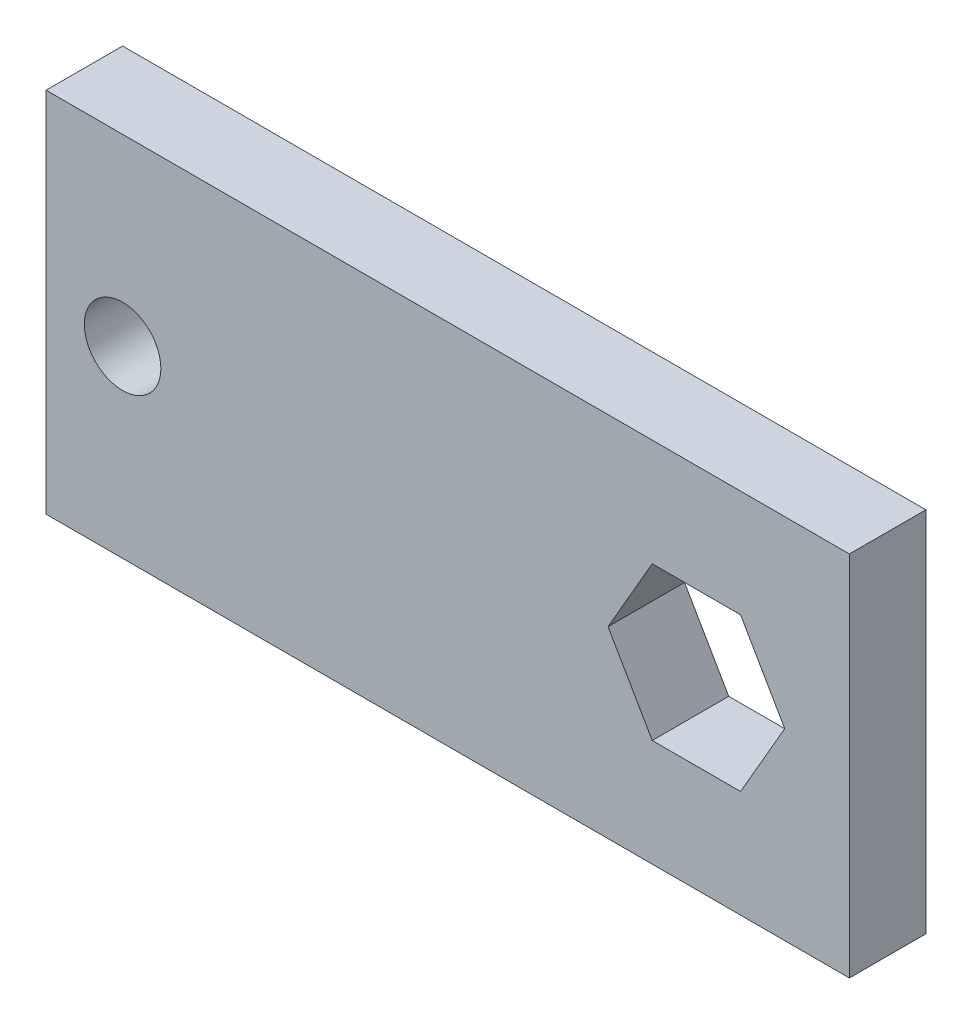
ISO-10303-21;
HEADER;
FILE_DESCRIPTION(('STEP AP214'),'2;1');
FILE_NAME('part.step','',(''),(''),'','','');
FILE_SCHEMA(('AUTOMOTIVE_DESIGN { 1 0 10303 214 1 1 1 1 }'));
ENDSEC;
DATA;
#1=APPLICATION_CONTEXT('core data for automotive mechanical design processes');
#2=APPLICATION_PROTOCOL_DEFINITION('international standard','automotive_design',2000,#1);
#3=PRODUCT_CONTEXT('',#1,'mechanical');
#4=PRODUCT('Part','Part','',(#3));
#5=PRODUCT_RELATED_PRODUCT_CATEGORY('part','',(#4));
#6=PRODUCT_DEFINITION_FORMATION('','',#4);
#7=PRODUCT_DEFINITION_CONTEXT('part definition',#1,'design');
#8=PRODUCT_DEFINITION('design','',#6,#7);
#9=PRODUCT_DEFINITION_SHAPE('','',#8);
#10=(LENGTH_UNIT() NAMED_UNIT(*) SI_UNIT(.MILLI.,.METRE.));
#11=(NAMED_UNIT(*) PLANE_ANGLE_UNIT() SI_UNIT($,.RADIAN.));
#12=(NAMED_UNIT(*) SI_UNIT($,.STERADIAN.) SOLID_ANGLE_UNIT());
#13=UNCERTAINTY_MEASURE_WITH_UNIT(LENGTH_MEASURE(1.E-05),#10,'distance_accuracy_value','');
#14=(GEOMETRIC_REPRESENTATION_CONTEXT(3) GLOBAL_UNCERTAINTY_ASSIGNED_CONTEXT((#13)) GLOBAL_UNIT_ASSIGNED_CONTEXT((#10,
#11,#12)) REPRESENTATION_CONTEXT('',''));
#15=CARTESIAN_POINT('',(0.,0.,0.));
#16=DIRECTION('',(0.,0.,1.));
#17=DIRECTION('',(1.,0.,0.));
#18=AXIS2_PLACEMENT_3D('',#15,#16,#17);
#19=CARTESIAN_POINT('',(0.,15.24,6.35));
#20=DIRECTION('',(0.,-1.,0.));
#21=DIRECTION('',(1.,0.,0.));
#22=AXIS2_PLACEMENT_3D('',#19,#20,#21);
#23=PLANE('',#22);
#24=DIRECTION('',(-1.,0.,0.));
#25=VECTOR('',#24,1.);
#26=CARTESIAN_POINT('',(0.,15.24,0.));
#27=LINE('',#26,#25);
#28=CARTESIAN_POINT('',(12.7,15.24,0.));
#29=VERTEX_POINT('',#28);
#30=CARTESIAN_POINT('',(-53.975,15.24,0.));
#31=VERTEX_POINT('',#30);
#32=EDGE_CURVE('E163',#29,#31,#27,.T.);
#33=ORIENTED_EDGE('',*,*,#32,.T.);
#34=DIRECTION('',(0.,0.,-1.));
#35=VECTOR('',#34,1.);
#36=CARTESIAN_POINT('',(-53.975,15.24,6.35));
#37=LINE('',#36,#35);
#38=CARTESIAN_POINT('',(-53.975,15.24,6.35));
#39=VERTEX_POINT('',#38);
#40=EDGE_CURVE('E11',#39,#31,#37,.T.);
#41=ORIENTED_EDGE('',*,*,#40,.F.);
#42=DIRECTION('',(-1.,0.,0.));
#43=VECTOR('',#42,1.);
#44=CARTESIAN_POINT('',(0.,15.24,6.35));
#45=LINE('',#44,#43);
#46=CARTESIAN_POINT('',(12.7,15.24,6.35));
#47=VERTEX_POINT('',#46);
#48=EDGE_CURVE('E125',#47,#39,#45,.T.);
#49=ORIENTED_EDGE('',*,*,#48,.F.);
#50=DIRECTION('',(0.,0.,-1.));
#51=VECTOR('',#50,1.);
#52=CARTESIAN_POINT('',(12.7,15.24,6.35));
#53=LINE('',#52,#51);
#54=EDGE_CURVE('E53',#47,#29,#53,.T.);
#55=ORIENTED_EDGE('',*,*,#54,.T.);
#56=EDGE_LOOP('',(#33,#41,#49,#55));
#57=FACE_BOUND('',#56,.T.);
#58=ADVANCED_FACE('F34',(#57),#23,.F.);
#59=CARTESIAN_POINT('',(-53.975,0.,6.35));
#60=DIRECTION('',(1.,0.,0.));
#61=DIRECTION('',(0.,0.,-1.));
#62=AXIS2_PLACEMENT_3D('',#59,#60,#61);
#63=PLANE('',#62);
#64=DIRECTION('',(0.,-1.,0.));
#65=VECTOR('',#64,1.);
#66=CARTESIAN_POINT('',(-53.975,0.,0.));
#67=LINE('',#66,#65);
#68=CARTESIAN_POINT('',(-53.975,-15.24,0.));
#69=VERTEX_POINT('',#68);
#70=EDGE_CURVE('E131',#31,#69,#67,.T.);
#71=ORIENTED_EDGE('',*,*,#70,.T.);
#72=DIRECTION('',(0.,0.,-1.));
#73=VECTOR('',#72,1.);
#74=CARTESIAN_POINT('',(-53.975,-15.24,6.35));
#75=LINE('',#74,#73);
#76=CARTESIAN_POINT('',(-53.975,-15.24,6.35));
#77=VERTEX_POINT('',#76);
#78=EDGE_CURVE('E44',#77,#69,#75,.T.);
#79=ORIENTED_EDGE('',*,*,#78,.F.);
#80=DIRECTION('',(0.,-1.,0.));
#81=VECTOR('',#80,1.);
#82=CARTESIAN_POINT('',(-53.975,0.,6.35));
#83=LINE('',#82,#81);
#84=EDGE_CURVE('E119',#39,#77,#83,.T.);
#85=ORIENTED_EDGE('',*,*,#84,.F.);
#86=ORIENTED_EDGE('',*,*,#40,.T.);
#87=EDGE_LOOP('',(#71,#79,#85,#86));
#88=FACE_BOUND('',#87,.T.);
#89=ADVANCED_FACE('F130',(#88),#63,.F.);
#90=CARTESIAN_POINT('',(0.,-15.24,6.35));
#91=DIRECTION('',(0.,-1.,0.));
#92=DIRECTION('',(1.,0.,0.));
#93=AXIS2_PLACEMENT_3D('',#90,#91,#92);
#94=PLANE('',#93);
#95=DIRECTION('',(-1.,0.,0.));
#96=VECTOR('',#95,1.);
#97=CARTESIAN_POINT('',(0.,-15.24,0.));
#98=LINE('',#97,#96);
#99=CARTESIAN_POINT('',(12.7,-15.24,0.));
#100=VERTEX_POINT('',#99);
#101=EDGE_CURVE('E166',#100,#69,#98,.T.);
#102=ORIENTED_EDGE('',*,*,#101,.F.);
#103=DIRECTION('',(0.,0.,-1.));
#104=VECTOR('',#103,1.);
#105=CARTESIAN_POINT('',(12.7,-15.24,6.35));
#106=LINE('',#105,#104);
#107=CARTESIAN_POINT('',(12.7,-15.24,6.35));
#108=VERTEX_POINT('',#107);
#109=EDGE_CURVE('E85',#108,#100,#106,.T.);
#110=ORIENTED_EDGE('',*,*,#109,.F.);
#111=DIRECTION('',(-1.,0.,0.));
#112=VECTOR('',#111,1.);
#113=CARTESIAN_POINT('',(0.,-15.24,6.35));
#114=LINE('',#113,#112);
#115=EDGE_CURVE('E124',#108,#77,#114,.T.);
#116=ORIENTED_EDGE('',*,*,#115,.T.);
#117=ORIENTED_EDGE('',*,*,#78,.T.);
#118=EDGE_LOOP('',(#102,#110,#116,#117));
#119=FACE_BOUND('',#118,.T.);
#120=ADVANCED_FACE('F135',(#119),#94,.T.);
#121=CARTESIAN_POINT('',(5.49926131403119,3.175,6.35));
#122=DIRECTION('',(-0.866025403784438,-0.5,0.));
#123=DIRECTION('',(0.5,-0.866025403784438,0.));
#124=AXIS2_PLACEMENT_3D('',#121,#122,#123);
#125=PLANE('',#124);
#126=DIRECTION('',(-0.5,0.866025403784438,0.));
#127=VECTOR('',#126,1.);
#128=CARTESIAN_POINT('',(5.49926131403119,3.175,0.));
#129=LINE('',#128,#127);
#130=CARTESIAN_POINT('',(7.33234841870825,0.,0.));
#131=VERTEX_POINT('',#130);
#132=CARTESIAN_POINT('',(3.66617420935412,6.35,0.));
#133=VERTEX_POINT('',#132);
#134=EDGE_CURVE('E145',#131,#133,#129,.T.);
#135=ORIENTED_EDGE('',*,*,#134,.F.);
#136=DIRECTION('',(0.,0.,-1.));
#137=VECTOR('',#136,1.);
#138=CARTESIAN_POINT('',(7.33234841870825,0.,6.35));
#139=LINE('',#138,#137);
#140=CARTESIAN_POINT('',(7.33234841870825,0.,6.35));
#141=VERTEX_POINT('',#140);
#142=EDGE_CURVE('E38',#141,#131,#139,.T.);
#143=ORIENTED_EDGE('',*,*,#142,.F.);
#144=DIRECTION('',(-0.5,0.866025403784438,0.));
#145=VECTOR('',#144,1.);
#146=CARTESIAN_POINT('',(5.49926131403119,3.175,6.35));
#147=LINE('',#146,#145);
#148=CARTESIAN_POINT('',(3.66617420935412,6.35,6.35));
#149=VERTEX_POINT('',#148);
#150=EDGE_CURVE('E219',#141,#149,#147,.T.);
#151=ORIENTED_EDGE('',*,*,#150,.T.);
#152=DIRECTION('',(0.,0.,-1.));
#153=VECTOR('',#152,1.);
#154=CARTESIAN_POINT('',(3.66617420935412,6.35,6.35));
#155=LINE('',#154,#153);
#156=EDGE_CURVE('E138',#149,#133,#155,.T.);
#157=ORIENTED_EDGE('',*,*,#156,.T.);
#158=EDGE_LOOP('',(#135,#143,#151,#157));
#159=FACE_BOUND('',#158,.T.);
#160=ADVANCED_FACE('F190',(#159),#125,.T.);
#161=CARTESIAN_POINT('',(5.49926131403119,-3.175,6.35));
#162=DIRECTION('',(-0.866025403784439,0.5,0.));
#163=DIRECTION('',(-0.5,-0.866025403784439,0.));
#164=AXIS2_PLACEMENT_3D('',#161,#162,#163);
#165=PLANE('',#164);
#166=DIRECTION('',(0.5,0.866025403784439,0.));
#167=VECTOR('',#166,1.);
#168=CARTESIAN_POINT('',(5.49926131403119,-3.175,0.));
#169=LINE('',#168,#167);
#170=CARTESIAN_POINT('',(3.66617420935413,-6.35,0.));
#171=VERTEX_POINT('',#170);
#172=EDGE_CURVE('E148',#171,#131,#169,.T.);
#173=ORIENTED_EDGE('',*,*,#172,.F.);
#174=DIRECTION('',(0.,0.,-1.));
#175=VECTOR('',#174,1.);
#176=CARTESIAN_POINT('',(3.66617420935413,-6.35,6.35));
#177=LINE('',#176,#175);
#178=CARTESIAN_POINT('',(3.66617420935413,-6.35,6.35));
#179=VERTEX_POINT('',#178);
#180=EDGE_CURVE('E180',#179,#171,#177,.T.);
#181=ORIENTED_EDGE('',*,*,#180,.F.);
#182=DIRECTION('',(0.5,0.866025403784439,0.));
#183=VECTOR('',#182,1.);
#184=CARTESIAN_POINT('',(5.49926131403119,-3.175,6.35));
#185=LINE('',#184,#183);
#186=EDGE_CURVE('E189',#179,#141,#185,.T.);
#187=ORIENTED_EDGE('',*,*,#186,.T.);
#188=ORIENTED_EDGE('',*,*,#142,.T.);
#189=EDGE_LOOP('',(#173,#181,#187,#188));
#190=FACE_BOUND('',#189,.T.);
#191=ADVANCED_FACE('F187',(#190),#165,.T.);
#192=CARTESIAN_POINT('',(0.,-6.35,6.35));
#193=DIRECTION('',(0.,1.,0.));
#194=DIRECTION('',(-1.,0.,0.));
#195=AXIS2_PLACEMENT_3D('',#192,#193,#194);
#196=PLANE('',#195);
#197=DIRECTION('',(1.,0.,0.));
#198=VECTOR('',#197,1.);
#199=CARTESIAN_POINT('',(0.,-6.35,0.));
#200=LINE('',#199,#198);
#201=CARTESIAN_POINT('',(-3.66617420935412,-6.35,0.));
#202=VERTEX_POINT('',#201);
#203=EDGE_CURVE('E151',#202,#171,#200,.T.);
#204=ORIENTED_EDGE('',*,*,#203,.F.);
#205=DIRECTION('',(0.,0.,-1.));
#206=VECTOR('',#205,1.);
#207=CARTESIAN_POINT('',(-3.66617420935412,-6.35,6.35));
#208=LINE('',#207,#206);
#209=CARTESIAN_POINT('',(-3.66617420935412,-6.35,6.35));
#210=VERTEX_POINT('',#209);
#211=EDGE_CURVE('E179',#210,#202,#208,.T.);
#212=ORIENTED_EDGE('',*,*,#211,.F.);
#213=DIRECTION('',(1.,0.,0.));
#214=VECTOR('',#213,1.);
#215=CARTESIAN_POINT('',(0.,-6.35,6.35));
#216=LINE('',#215,#214);
#217=EDGE_CURVE('E198',#210,#179,#216,.T.);
#218=ORIENTED_EDGE('',*,*,#217,.T.);
#219=ORIENTED_EDGE('',*,*,#180,.T.);
#220=EDGE_LOOP('',(#204,#212,#218,#219));
#221=FACE_BOUND('',#220,.T.);
#222=ADVANCED_FACE('F196',(#221),#196,.T.);
#223=CARTESIAN_POINT('',(-5.49926131403118,-3.175,6.35));
#224=DIRECTION('',(0.866025403784438,0.5,0.));
#225=DIRECTION('',(-0.5,0.866025403784438,0.));
#226=AXIS2_PLACEMENT_3D('',#223,#224,#225);
#227=PLANE('',#226);
#228=DIRECTION('',(0.5,-0.866025403784438,0.));
#229=VECTOR('',#228,1.);
#230=CARTESIAN_POINT('',(-5.49926131403118,-3.175,0.));
#231=LINE('',#230,#229);
#232=CARTESIAN_POINT('',(-7.33234841870825,0.,0.));
#233=VERTEX_POINT('',#232);
#234=EDGE_CURVE('E154',#233,#202,#231,.T.);
#235=ORIENTED_EDGE('',*,*,#234,.F.);
#236=DIRECTION('',(0.,0.,-1.));
#237=VECTOR('',#236,1.);
#238=CARTESIAN_POINT('',(-7.33234841870825,0.,6.35));
#239=LINE('',#238,#237);
#240=CARTESIAN_POINT('',(-7.33234841870825,0.,6.35));
#241=VERTEX_POINT('',#240);
#242=EDGE_CURVE('E177',#241,#233,#239,.T.);
#243=ORIENTED_EDGE('',*,*,#242,.F.);
#244=DIRECTION('',(0.5,-0.866025403784438,0.));
#245=VECTOR('',#244,1.);
#246=CARTESIAN_POINT('',(-5.49926131403118,-3.175,6.35));
#247=LINE('',#246,#245);
#248=EDGE_CURVE('E204',#241,#210,#247,.T.);
#249=ORIENTED_EDGE('',*,*,#248,.T.);
#250=ORIENTED_EDGE('',*,*,#211,.T.);
#251=EDGE_LOOP('',(#235,#243,#249,#250));
#252=FACE_BOUND('',#251,.T.);
#253=ADVANCED_FACE('F207',(#252),#227,.T.);
#254=CARTESIAN_POINT('',(-5.49926131403119,3.175,6.35));
#255=DIRECTION('',(0.866025403784439,-0.5,0.));
#256=DIRECTION('',(0.5,0.866025403784439,0.));
#257=AXIS2_PLACEMENT_3D('',#254,#255,#256);
#258=PLANE('',#257);
#259=DIRECTION('',(-0.5,-0.866025403784439,0.));
#260=VECTOR('',#259,1.);
#261=CARTESIAN_POINT('',(-5.49926131403119,3.175,0.));
#262=LINE('',#261,#260);
#263=CARTESIAN_POINT('',(-3.66617420935413,6.35,0.));
#264=VERTEX_POINT('',#263);
#265=EDGE_CURVE('E157',#264,#233,#262,.T.);
#266=ORIENTED_EDGE('',*,*,#265,.F.);
#267=DIRECTION('',(0.,0.,-1.));
#268=VECTOR('',#267,1.);
#269=CARTESIAN_POINT('',(-3.66617420935413,6.35,6.35));
#270=LINE('',#269,#268);
#271=CARTESIAN_POINT('',(-3.66617420935413,6.35,6.35));
#272=VERTEX_POINT('',#271);
#273=EDGE_CURVE('E175',#272,#264,#270,.T.);
#274=ORIENTED_EDGE('',*,*,#273,.F.);
#275=DIRECTION('',(-0.5,-0.866025403784439,0.));
#276=VECTOR('',#275,1.);
#277=CARTESIAN_POINT('',(-5.49926131403119,3.175,6.35));
#278=LINE('',#277,#276);
#279=EDGE_CURVE('E208',#272,#241,#278,.T.);
#280=ORIENTED_EDGE('',*,*,#279,.T.);
#281=ORIENTED_EDGE('',*,*,#242,.T.);
#282=EDGE_LOOP('',(#266,#274,#280,#281));
#283=FACE_BOUND('',#282,.T.);
#284=ADVANCED_FACE('F221',(#283),#258,.T.);
#285=CARTESIAN_POINT('',(0.,6.35,6.35));
#286=DIRECTION('',(0.,-1.,0.));
#287=DIRECTION('',(1.,0.,0.));
#288=AXIS2_PLACEMENT_3D('',#285,#286,#287);
#289=PLANE('',#288);
#290=DIRECTION('',(-1.,0.,0.));
#291=VECTOR('',#290,1.);
#292=CARTESIAN_POINT('',(0.,6.35,0.));
#293=LINE('',#292,#291);
#294=EDGE_CURVE('E160',#133,#264,#293,.T.);
#295=ORIENTED_EDGE('',*,*,#294,.F.);
#296=ORIENTED_EDGE('',*,*,#156,.F.);
#297=DIRECTION('',(-1.,0.,0.));
#298=VECTOR('',#297,1.);
#299=CARTESIAN_POINT('',(0.,6.35,6.35));
#300=LINE('',#299,#298);
#301=EDGE_CURVE('E210',#149,#272,#300,.T.);
#302=ORIENTED_EDGE('',*,*,#301,.T.);
#303=ORIENTED_EDGE('',*,*,#273,.T.);
#304=EDGE_LOOP('',(#295,#296,#302,#303));
#305=FACE_BOUND('',#304,.T.);
#306=ADVANCED_FACE('F217',(#305),#289,.T.);
#307=CARTESIAN_POINT('',(-47.625,0.,6.35));
#308=DIRECTION('',(0.,0.,-1.));
#309=DIRECTION('',(-1.,0.,0.));
#310=AXIS2_PLACEMENT_3D('',#307,#308,#309);
#311=CYLINDRICAL_SURFACE('',#310,3.17500000000001);
#312=CARTESIAN_POINT('',(-47.625,0.,6.35));
#313=DIRECTION('',(0.,0.,1.));
#314=DIRECTION('',(1.,0.,0.));
#315=AXIS2_PLACEMENT_3D('',#312,#313,#314);
#316=CIRCLE('',#315,3.17500000000001);
#317=CARTESIAN_POINT('',(-44.45,0.,6.35));
#318=VERTEX_POINT('',#317);
#319=EDGE_CURVE('E171',#318,#318,#316,.T.);
#320=ORIENTED_EDGE('',*,*,#319,.T.);
#321=EDGE_LOOP('',(#320));
#322=FACE_BOUND('',#321,.T.);
#323=CARTESIAN_POINT('',(-47.625,0.,0.));
#324=DIRECTION('',(0.,0.,1.));
#325=DIRECTION('',(1.,0.,0.));
#326=AXIS2_PLACEMENT_3D('',#323,#324,#325);
#327=CIRCLE('',#326,3.17500000000001);
#328=CARTESIAN_POINT('',(-44.45,0.,0.));
#329=VERTEX_POINT('',#328);
#330=EDGE_CURVE('E142',#329,#329,#327,.T.);
#331=ORIENTED_EDGE('',*,*,#330,.F.);
#332=EDGE_LOOP('',(#331));
#333=FACE_BOUND('',#332,.T.);
#334=ADVANCED_FACE('F36',(#322,#333),#311,.F.);
#335=CARTESIAN_POINT('',(12.7,0.,6.35));
#336=DIRECTION('',(1.,0.,0.));
#337=DIRECTION('',(0.,0.,-1.));
#338=AXIS2_PLACEMENT_3D('',#335,#336,#337);
#339=PLANE('',#338);
#340=DIRECTION('',(0.,-1.,0.));
#341=VECTOR('',#340,1.);
#342=CARTESIAN_POINT('',(12.7,0.,0.));
#343=LINE('',#342,#341);
#344=EDGE_CURVE('E168',#29,#100,#343,.T.);
#345=ORIENTED_EDGE('',*,*,#344,.F.);
#346=ORIENTED_EDGE('',*,*,#54,.F.);
#347=DIRECTION('',(0.,-1.,0.));
#348=VECTOR('',#347,1.);
#349=CARTESIAN_POINT('',(12.7,0.,6.35));
#350=LINE('',#349,#348);
#351=EDGE_CURVE('E136',#47,#108,#350,.T.);
#352=ORIENTED_EDGE('',*,*,#351,.T.);
#353=ORIENTED_EDGE('',*,*,#109,.T.);
#354=EDGE_LOOP('',(#345,#346,#352,#353));
#355=FACE_BOUND('',#354,.T.);
#356=ADVANCED_FACE('F239',(#355),#339,.T.);
#357=CARTESIAN_POINT('',(0.,0.,6.35));
#358=DIRECTION('',(0.,0.,1.));
#359=DIRECTION('',(1.,0.,0.));
#360=AXIS2_PLACEMENT_3D('',#357,#358,#359);
#361=PLANE('',#360);
#362=ORIENTED_EDGE('',*,*,#319,.F.);
#363=EDGE_LOOP('',(#362));
#364=FACE_BOUND('',#363,.T.);
#365=ORIENTED_EDGE('',*,*,#150,.F.);
#366=ORIENTED_EDGE('',*,*,#186,.F.);
#367=ORIENTED_EDGE('',*,*,#217,.F.);
#368=ORIENTED_EDGE('',*,*,#248,.F.);
#369=ORIENTED_EDGE('',*,*,#279,.F.);
#370=ORIENTED_EDGE('',*,*,#301,.F.);
#371=EDGE_LOOP('',(#365,#366,#367,#368,#369,#370));
#372=FACE_BOUND('',#371,.T.);
#373=ORIENTED_EDGE('',*,*,#48,.T.);
#374=ORIENTED_EDGE('',*,*,#84,.T.);
#375=ORIENTED_EDGE('',*,*,#115,.F.);
#376=ORIENTED_EDGE('',*,*,#351,.F.);
#377=EDGE_LOOP('',(#373,#374,#375,#376));
#378=FACE_BOUND('',#377,.T.);
#379=ADVANCED_FACE('F121',(#364,#372,#378),#361,.T.);
#380=CARTESIAN_POINT('',(0.,0.,0.));
#381=DIRECTION('',(0.,0.,1.));
#382=DIRECTION('',(1.,0.,0.));
#383=AXIS2_PLACEMENT_3D('',#380,#381,#382);
#384=PLANE('',#383);
#385=ORIENTED_EDGE('',*,*,#330,.T.);
#386=EDGE_LOOP('',(#385));
#387=FACE_BOUND('',#386,.T.);
#388=ORIENTED_EDGE('',*,*,#134,.T.);
#389=ORIENTED_EDGE('',*,*,#294,.T.);
#390=ORIENTED_EDGE('',*,*,#265,.T.);
#391=ORIENTED_EDGE('',*,*,#234,.T.);
#392=ORIENTED_EDGE('',*,*,#203,.T.);
#393=ORIENTED_EDGE('',*,*,#172,.T.);
#394=EDGE_LOOP('',(#388,#389,#390,#391,#392,#393));
#395=FACE_BOUND('',#394,.T.);
#396=ORIENTED_EDGE('',*,*,#32,.F.);
#397=ORIENTED_EDGE('',*,*,#344,.T.);
#398=ORIENTED_EDGE('',*,*,#101,.T.);
#399=ORIENTED_EDGE('',*,*,#70,.F.);
#400=EDGE_LOOP('',(#396,#397,#398,#399));
#401=FACE_BOUND('',#400,.T.);
#402=ADVANCED_FACE('F193',(#387,#395,#401),#384,.F.);
#403=CLOSED_SHELL('',(#58,#89,#120,#160,#191,#222,#253,#284,#306,#334,#356,#379,#402));
#404=MANIFOLD_SOLID_BREP('B2',#403);
#405=ADVANCED_BREP_SHAPE_REPRESENTATION('',(#18,#404),#14);
#406=SHAPE_DEFINITION_REPRESENTATION(#9,#405);
ENDSEC;
END-ISO-10303-21;
